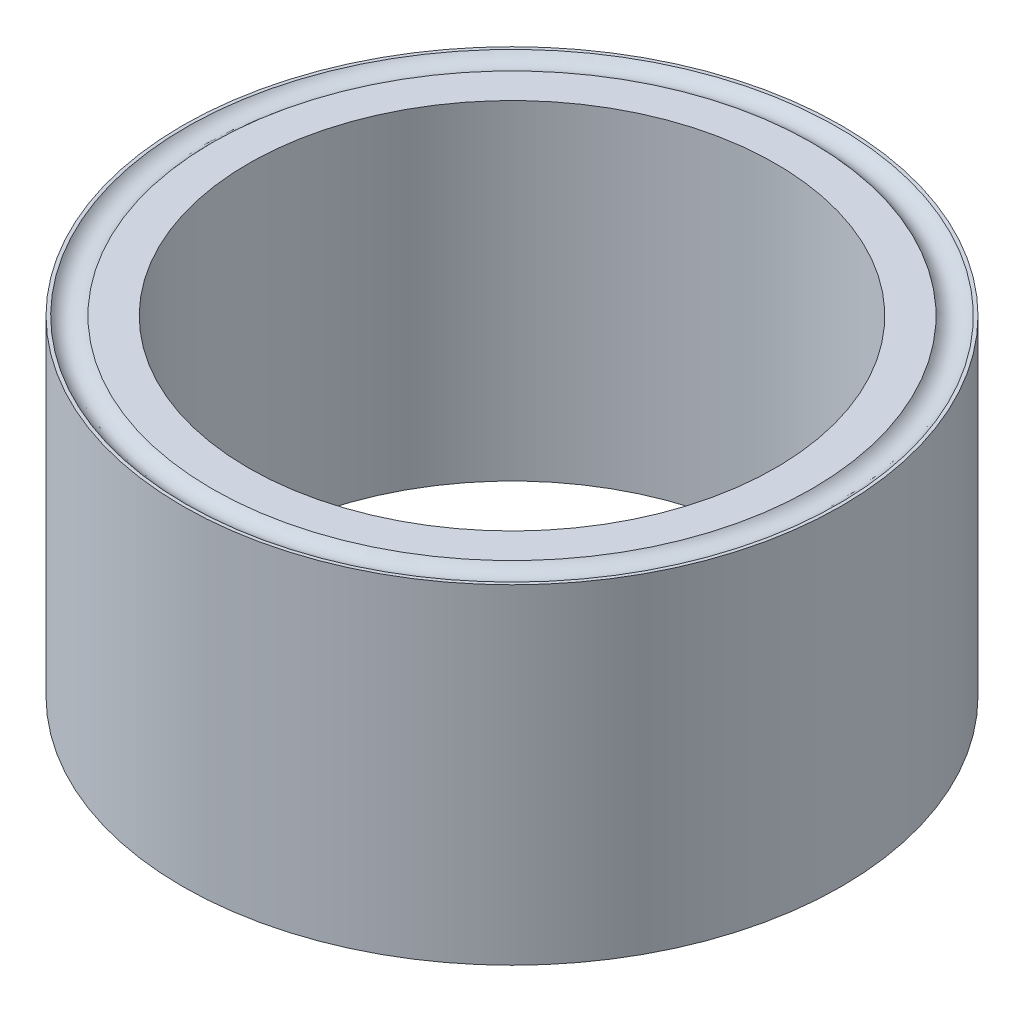
ISO-10303-21;
HEADER;
FILE_DESCRIPTION(('STEP AP214'),'2;1');
FILE_NAME('part.step','',(''),(''),'','','');
FILE_SCHEMA(('AUTOMOTIVE_DESIGN { 1 0 10303 214 1 1 1 1 }'));
ENDSEC;
DATA;
#1=APPLICATION_CONTEXT('core data for automotive mechanical design processes');
#2=APPLICATION_PROTOCOL_DEFINITION('international standard','automotive_design',2000,#1);
#3=PRODUCT_CONTEXT('',#1,'mechanical');
#4=PRODUCT('Part','Part','',(#3));
#5=PRODUCT_RELATED_PRODUCT_CATEGORY('part','',(#4));
#6=PRODUCT_DEFINITION_FORMATION('','',#4);
#7=PRODUCT_DEFINITION_CONTEXT('part definition',#1,'design');
#8=PRODUCT_DEFINITION('design','',#6,#7);
#9=PRODUCT_DEFINITION_SHAPE('','',#8);
#10=(LENGTH_UNIT() NAMED_UNIT(*) SI_UNIT(.MILLI.,.METRE.));
#11=(NAMED_UNIT(*) PLANE_ANGLE_UNIT() SI_UNIT($,.RADIAN.));
#12=(NAMED_UNIT(*) SI_UNIT($,.STERADIAN.) SOLID_ANGLE_UNIT());
#13=UNCERTAINTY_MEASURE_WITH_UNIT(LENGTH_MEASURE(1.E-05),#10,'distance_accuracy_value','');
#14=(GEOMETRIC_REPRESENTATION_CONTEXT(3) GLOBAL_UNCERTAINTY_ASSIGNED_CONTEXT((#13)) GLOBAL_UNIT_ASSIGNED_CONTEXT((#10,
#11,#12)) REPRESENTATION_CONTEXT('',''));
#15=CARTESIAN_POINT('',(0.,0.,0.));
#16=DIRECTION('',(0.,0.,1.));
#17=DIRECTION('',(1.,0.,0.));
#18=AXIS2_PLACEMENT_3D('',#15,#16,#17);
#19=CARTESIAN_POINT('',(0.,25.,0.));
#20=DIRECTION('',(0.,1.,0.));
#21=DIRECTION('',(0.,0.,1.));
#22=AXIS2_PLACEMENT_3D('',#19,#20,#21);
#23=PLANE('',#22);
#24=CARTESIAN_POINT('',(0.,25.,0.));
#25=DIRECTION('',(0.,1.,0.));
#26=DIRECTION('',(0.,0.,1.));
#27=AXIS2_PLACEMENT_3D('',#24,#25,#26);
#28=CIRCLE('',#27,25.);
#29=CARTESIAN_POINT('',(0.,25.,25.));
#30=VERTEX_POINT('',#29);
#31=EDGE_CURVE('E10',#30,#30,#28,.T.);
#32=ORIENTED_EDGE('',*,*,#31,.T.);
#33=EDGE_LOOP('',(#32));
#34=FACE_BOUND('',#33,.T.);
#35=CARTESIAN_POINT('',(0.,25.,0.));
#36=DIRECTION('',(0.,1.,0.));
#37=DIRECTION('',(0.,0.,1.));
#38=AXIS2_PLACEMENT_3D('',#35,#36,#37);
#39=CIRCLE('',#38,24.75);
#40=CARTESIAN_POINT('',(0.,25.,24.75));
#41=VERTEX_POINT('',#40);
#42=EDGE_CURVE('E58',#41,#41,#39,.T.);
#43=ORIENTED_EDGE('',*,*,#42,.F.);
#44=EDGE_LOOP('',(#43));
#45=FACE_BOUND('',#44,.T.);
#46=ADVANCED_FACE('F37',(#34,#45),#23,.T.);
#47=CARTESIAN_POINT('',(0.,25.,0.));
#48=DIRECTION('',(0.,1.,0.));
#49=DIRECTION('',(0.,0.,1.));
#50=AXIS2_PLACEMENT_3D('',#47,#48,#49);
#51=CIRCLE('',#50,20.);
#52=CARTESIAN_POINT('',(0.,25.,20.));
#53=VERTEX_POINT('',#52);
#54=EDGE_CURVE('E48',#53,#53,#51,.T.);
#55=ORIENTED_EDGE('',*,*,#54,.F.);
#56=EDGE_LOOP('',(#55));
#57=FACE_BOUND('',#56,.T.);
#58=CARTESIAN_POINT('',(0.,25.,0.));
#59=DIRECTION('',(0.,1.,0.));
#60=DIRECTION('',(0.,0.,1.));
#61=AXIS2_PLACEMENT_3D('',#58,#59,#60);
#62=CIRCLE('',#61,22.75);
#63=CARTESIAN_POINT('',(0.,25.,22.75));
#64=VERTEX_POINT('',#63);
#65=EDGE_CURVE('E53',#64,#64,#62,.T.);
#66=ORIENTED_EDGE('',*,*,#65,.T.);
#67=EDGE_LOOP('',(#66));
#68=FACE_BOUND('',#67,.T.);
#69=ADVANCED_FACE('F65',(#57,#68),#23,.T.);
#70=CARTESIAN_POINT('',(0.,0.,0.));
#71=DIRECTION('',(0.,1.,0.));
#72=DIRECTION('',(0.,0.,1.));
#73=AXIS2_PLACEMENT_3D('',#70,#71,#72);
#74=PLANE('',#73);
#75=CARTESIAN_POINT('',(0.,0.,0.));
#76=DIRECTION('',(0.,1.,0.));
#77=DIRECTION('',(0.,0.,1.));
#78=AXIS2_PLACEMENT_3D('',#75,#76,#77);
#79=CIRCLE('',#78,25.);
#80=CARTESIAN_POINT('',(0.,0.,25.));
#81=VERTEX_POINT('',#80);
#82=EDGE_CURVE('E41',#81,#81,#79,.T.);
#83=ORIENTED_EDGE('',*,*,#82,.F.);
#84=EDGE_LOOP('',(#83));
#85=FACE_BOUND('',#84,.T.);
#86=CARTESIAN_POINT('',(0.,0.,0.));
#87=DIRECTION('',(0.,1.,0.));
#88=DIRECTION('',(0.,0.,1.));
#89=AXIS2_PLACEMENT_3D('',#86,#87,#88);
#90=CIRCLE('',#89,20.);
#91=CARTESIAN_POINT('',(0.,0.,20.));
#92=VERTEX_POINT('',#91);
#93=EDGE_CURVE('E50',#92,#92,#90,.T.);
#94=ORIENTED_EDGE('',*,*,#93,.T.);
#95=EDGE_LOOP('',(#94));
#96=FACE_BOUND('',#95,.T.);
#97=ADVANCED_FACE('F71',(#85,#96),#74,.F.);
#98=CARTESIAN_POINT('',(0.,25.,0.));
#99=DIRECTION('',(0.,-1.,0.));
#100=DIRECTION('',(0.,0.,-1.));
#101=AXIS2_PLACEMENT_3D('',#98,#99,#100);
#102=CYLINDRICAL_SURFACE('',#101,25.);
#103=ORIENTED_EDGE('',*,*,#31,.F.);
#104=EDGE_LOOP('',(#103));
#105=FACE_BOUND('',#104,.T.);
#106=ORIENTED_EDGE('',*,*,#82,.T.);
#107=EDGE_LOOP('',(#106));
#108=FACE_BOUND('',#107,.T.);
#109=ADVANCED_FACE('F39',(#105,#108),#102,.T.);
#110=CARTESIAN_POINT('',(0.,25.,0.));
#111=DIRECTION('',(0.,-1.,0.));
#112=DIRECTION('',(0.,0.,-1.));
#113=AXIS2_PLACEMENT_3D('',#110,#111,#112);
#114=CYLINDRICAL_SURFACE('',#113,20.);
#115=ORIENTED_EDGE('',*,*,#54,.T.);
#116=EDGE_LOOP('',(#115));
#117=FACE_BOUND('',#116,.T.);
#118=ORIENTED_EDGE('',*,*,#93,.F.);
#119=EDGE_LOOP('',(#118));
#120=FACE_BOUND('',#119,.T.);
#121=ADVANCED_FACE('F74',(#117,#120),#114,.F.);
#122=CARTESIAN_POINT('',(0.,25.75,0.));
#123=DIRECTION('',(0.,1.,0.));
#124=DIRECTION('',(0.,0.,1.));
#125=AXIS2_PLACEMENT_3D('',#122,#123,#124);
#126=TOROIDAL_SURFACE('',#125,23.75,1.25);
#127=ORIENTED_EDGE('',*,*,#65,.F.);
#128=EDGE_LOOP('',(#127));
#129=FACE_BOUND('',#128,.T.);
#130=ORIENTED_EDGE('',*,*,#42,.T.);
#131=EDGE_LOOP('',(#130));
#132=FACE_BOUND('',#131,.T.);
#133=ADVANCED_FACE('F62',(#129,#132),#126,.F.);
#134=CLOSED_SHELL('',(#46,#69,#97,#109,#121,#133));
#135=MANIFOLD_SOLID_BREP('B2',#134);
#136=ADVANCED_BREP_SHAPE_REPRESENTATION('',(#18,#135),#14);
#137=SHAPE_DEFINITION_REPRESENTATION(#9,#136);
ENDSEC;
END-ISO-10303-21;
